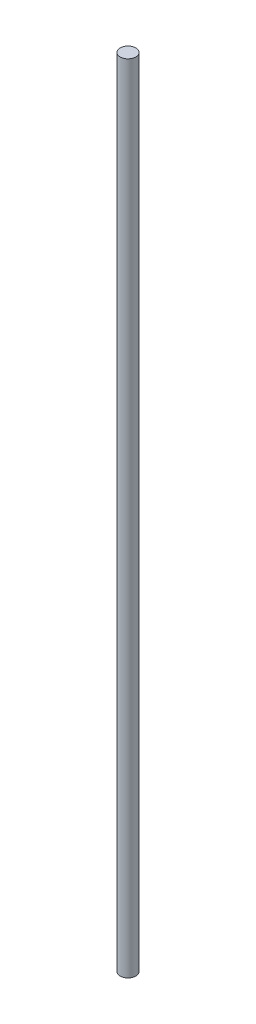
ISO-10303-21;
HEADER;
FILE_DESCRIPTION(('STEP AP214'),'2;1');
FILE_NAME('part.step','',(''),(''),'','','');
FILE_SCHEMA(('AUTOMOTIVE_DESIGN { 1 0 10303 214 1 1 1 1 }'));
ENDSEC;
DATA;
#1=APPLICATION_CONTEXT('core data for automotive mechanical design processes');
#2=APPLICATION_PROTOCOL_DEFINITION('international standard','automotive_design',2000,#1);
#3=PRODUCT_CONTEXT('',#1,'mechanical');
#4=PRODUCT('Part','Part','',(#3));
#5=PRODUCT_RELATED_PRODUCT_CATEGORY('part','',(#4));
#6=PRODUCT_DEFINITION_FORMATION('','',#4);
#7=PRODUCT_DEFINITION_CONTEXT('part definition',#1,'design');
#8=PRODUCT_DEFINITION('design','',#6,#7);
#9=PRODUCT_DEFINITION_SHAPE('','',#8);
#10=(LENGTH_UNIT() NAMED_UNIT(*) SI_UNIT(.MILLI.,.METRE.));
#11=(NAMED_UNIT(*) PLANE_ANGLE_UNIT() SI_UNIT($,.RADIAN.));
#12=(NAMED_UNIT(*) SI_UNIT($,.STERADIAN.) SOLID_ANGLE_UNIT());
#13=UNCERTAINTY_MEASURE_WITH_UNIT(LENGTH_MEASURE(1.E-05),#10,'distance_accuracy_value','');
#14=(GEOMETRIC_REPRESENTATION_CONTEXT(3) GLOBAL_UNCERTAINTY_ASSIGNED_CONTEXT((#13)) GLOBAL_UNIT_ASSIGNED_CONTEXT((#10,
#11,#12)) REPRESENTATION_CONTEXT('',''));
#15=CARTESIAN_POINT('',(0.,0.,0.));
#16=DIRECTION('',(0.,0.,1.));
#17=DIRECTION('',(1.,0.,0.));
#18=AXIS2_PLACEMENT_3D('',#15,#16,#17);
#19=CARTESIAN_POINT('',(0.,405.,0.));
#20=DIRECTION('',(0.,-1.,0.));
#21=DIRECTION('',(0.,0.,-1.));
#22=AXIS2_PLACEMENT_3D('',#19,#20,#21);
#23=CYLINDRICAL_SURFACE('',#22,4.);
#24=CARTESIAN_POINT('',(0.,405.,0.));
#25=DIRECTION('',(0.,1.,0.));
#26=DIRECTION('',(0.,0.,1.));
#27=AXIS2_PLACEMENT_3D('',#24,#25,#26);
#28=CIRCLE('',#27,4.);
#29=CARTESIAN_POINT('',(0.,405.,4.));
#30=VERTEX_POINT('',#29);
#31=EDGE_CURVE('E10',#30,#30,#28,.T.);
#32=ORIENTED_EDGE('',*,*,#31,.F.);
#33=EDGE_LOOP('',(#32));
#34=FACE_BOUND('',#33,.T.);
#35=CARTESIAN_POINT('',(0.,0.,0.));
#36=DIRECTION('',(0.,1.,0.));
#37=DIRECTION('',(0.,0.,1.));
#38=AXIS2_PLACEMENT_3D('',#35,#36,#37);
#39=CIRCLE('',#38,4.);
#40=CARTESIAN_POINT('',(0.,0.,4.));
#41=VERTEX_POINT('',#40);
#42=EDGE_CURVE('E34',#41,#41,#39,.T.);
#43=ORIENTED_EDGE('',*,*,#42,.T.);
#44=EDGE_LOOP('',(#43));
#45=FACE_BOUND('',#44,.T.);
#46=ADVANCED_FACE('F31',(#34,#45),#23,.T.);
#47=CARTESIAN_POINT('',(0.,405.,0.));
#48=DIRECTION('',(0.,1.,0.));
#49=DIRECTION('',(0.,0.,1.));
#50=AXIS2_PLACEMENT_3D('',#47,#48,#49);
#51=PLANE('',#50);
#52=ORIENTED_EDGE('',*,*,#31,.T.);
#53=EDGE_LOOP('',(#52));
#54=FACE_BOUND('',#53,.T.);
#55=ADVANCED_FACE('F46',(#54),#51,.T.);
#56=CARTESIAN_POINT('',(0.,0.,0.));
#57=DIRECTION('',(0.,1.,0.));
#58=DIRECTION('',(0.,0.,1.));
#59=AXIS2_PLACEMENT_3D('',#56,#57,#58);
#60=PLANE('',#59);
#61=ORIENTED_EDGE('',*,*,#42,.F.);
#62=EDGE_LOOP('',(#61));
#63=FACE_BOUND('',#62,.T.);
#64=ADVANCED_FACE('F44',(#63),#60,.F.);
#65=CLOSED_SHELL('',(#46,#55,#64));
#66=MANIFOLD_SOLID_BREP('B2',#65);
#67=ADVANCED_BREP_SHAPE_REPRESENTATION('',(#18,#66),#14);
#68=SHAPE_DEFINITION_REPRESENTATION(#9,#67);
ENDSEC;
END-ISO-10303-21;
